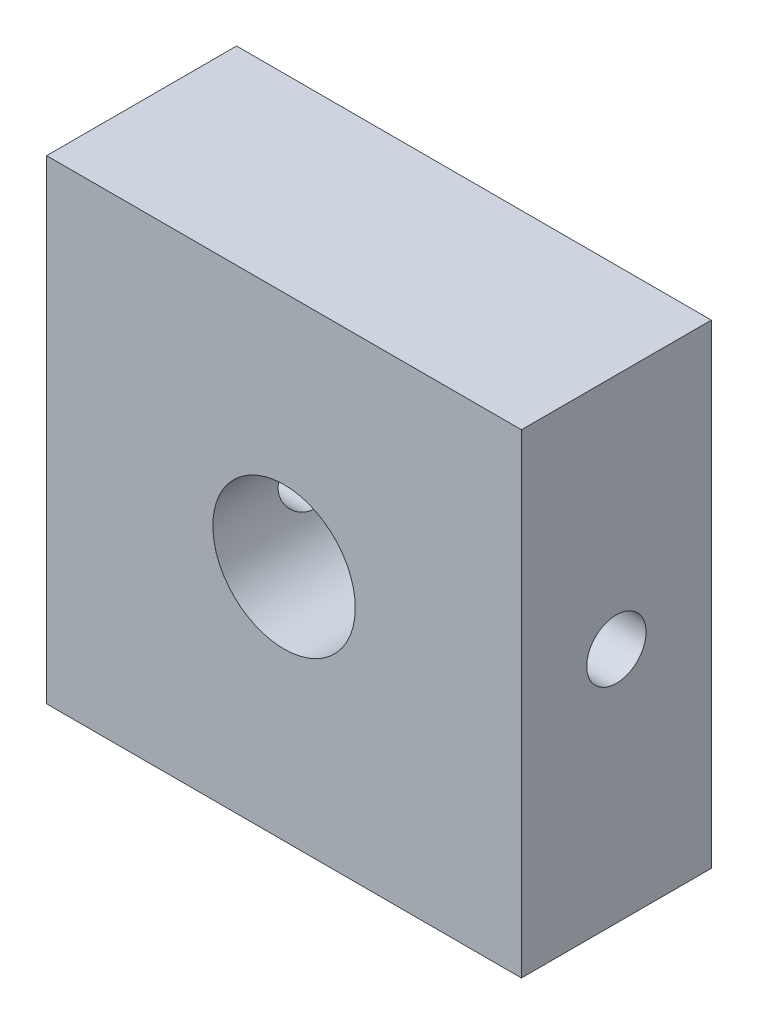
ISO-10303-21;
HEADER;
FILE_DESCRIPTION(('STEP AP214'),'2;1');
FILE_NAME('part.step','',(''),(''),'','','');
FILE_SCHEMA(('AUTOMOTIVE_DESIGN { 1 0 10303 214 1 1 1 1 }'));
ENDSEC;
DATA;
#1=APPLICATION_CONTEXT('core data for automotive mechanical design processes');
#2=APPLICATION_PROTOCOL_DEFINITION('international standard','automotive_design',2000,#1);
#3=PRODUCT_CONTEXT('',#1,'mechanical');
#4=PRODUCT('Part','Part','',(#3));
#5=PRODUCT_RELATED_PRODUCT_CATEGORY('part','',(#4));
#6=PRODUCT_DEFINITION_FORMATION('','',#4);
#7=PRODUCT_DEFINITION_CONTEXT('part definition',#1,'design');
#8=PRODUCT_DEFINITION('design','',#6,#7);
#9=PRODUCT_DEFINITION_SHAPE('','',#8);
#10=(LENGTH_UNIT() NAMED_UNIT(*) SI_UNIT(.MILLI.,.METRE.));
#11=(NAMED_UNIT(*) PLANE_ANGLE_UNIT() SI_UNIT($,.RADIAN.));
#12=(NAMED_UNIT(*) SI_UNIT($,.STERADIAN.) SOLID_ANGLE_UNIT());
#13=UNCERTAINTY_MEASURE_WITH_UNIT(LENGTH_MEASURE(1.E-05),#10,'distance_accuracy_value','');
#14=(GEOMETRIC_REPRESENTATION_CONTEXT(3) GLOBAL_UNCERTAINTY_ASSIGNED_CONTEXT((#13)) GLOBAL_UNIT_ASSIGNED_CONTEXT((#10,
#11,#12)) REPRESENTATION_CONTEXT('',''));
#15=CARTESIAN_POINT('',(0.,0.,0.));
#16=DIRECTION('',(0.,0.,1.));
#17=DIRECTION('',(1.,0.,0.));
#18=AXIS2_PLACEMENT_3D('',#15,#16,#17);
#19=CARTESIAN_POINT('',(-152.646542572468,-146.366308719574,8.));
#20=DIRECTION('',(-1.,0.,0.));
#21=DIRECTION('',(0.,0.,1.));
#22=AXIS2_PLACEMENT_3D('',#19,#20,#21);
#23=PLANE('',#22);
#24=CARTESIAN_POINT('',(-152.646542572468,-136.366308719574,4.));
#25=DIRECTION('',(1.,0.,0.));
#26=DIRECTION('',(0.,0.,-1.));
#27=AXIS2_PLACEMENT_3D('',#24,#25,#26);
#28=CIRCLE('',#27,1.25);
#29=CARTESIAN_POINT('',(-152.646542572468,-136.366308719574,2.75));
#30=VERTEX_POINT('',#29);
#31=EDGE_CURVE('E140',#30,#30,#28,.T.);
#32=ORIENTED_EDGE('',*,*,#31,.F.);
#33=EDGE_LOOP('',(#32));
#34=FACE_BOUND('',#33,.T.);
#35=DIRECTION('',(0.,1.,0.));
#36=VECTOR('',#35,1.);
#37=CARTESIAN_POINT('',(-152.646542572468,-146.366308719574,0.));
#38=LINE('',#37,#36);
#39=CARTESIAN_POINT('',(-152.646542572468,-146.366308719574,0.));
#40=VERTEX_POINT('',#39);
#41=CARTESIAN_POINT('',(-152.646542572468,-126.366308719574,0.));
#42=VERTEX_POINT('',#41);
#43=EDGE_CURVE('E104',#40,#42,#38,.T.);
#44=ORIENTED_EDGE('',*,*,#43,.T.);
#45=DIRECTION('',(0.,0.,-1.));
#46=VECTOR('',#45,1.);
#47=CARTESIAN_POINT('',(-152.646542572468,-126.366308719574,8.));
#48=LINE('',#47,#46);
#49=CARTESIAN_POINT('',(-152.646542572468,-126.366308719574,8.));
#50=VERTEX_POINT('',#49);
#51=EDGE_CURVE('E11',#50,#42,#48,.T.);
#52=ORIENTED_EDGE('',*,*,#51,.F.);
#53=DIRECTION('',(0.,1.,0.));
#54=VECTOR('',#53,1.);
#55=CARTESIAN_POINT('',(-152.646542572468,-146.366308719574,8.));
#56=LINE('',#55,#54);
#57=CARTESIAN_POINT('',(-152.646542572468,-146.366308719574,8.));
#58=VERTEX_POINT('',#57);
#59=EDGE_CURVE('E91',#58,#50,#56,.T.);
#60=ORIENTED_EDGE('',*,*,#59,.F.);
#61=DIRECTION('',(0.,0.,-1.));
#62=VECTOR('',#61,1.);
#63=CARTESIAN_POINT('',(-152.646542572468,-146.366308719574,8.));
#64=LINE('',#63,#62);
#65=EDGE_CURVE('E100',#58,#40,#64,.T.);
#66=ORIENTED_EDGE('',*,*,#65,.T.);
#67=EDGE_LOOP('',(#44,#52,#60,#66));
#68=FACE_BOUND('',#67,.T.);
#69=ADVANCED_FACE('F33',(#34,#68),#23,.F.);
#70=CARTESIAN_POINT('',(-172.646542572468,-126.366308719574,8.));
#71=DIRECTION('',(0.,-1.,0.));
#72=DIRECTION('',(0.,0.,-1.));
#73=AXIS2_PLACEMENT_3D('',#70,#71,#72);
#74=PLANE('',#73);
#75=DIRECTION('',(-1.,0.,0.));
#76=VECTOR('',#75,1.);
#77=CARTESIAN_POINT('',(-172.646542572468,-126.366308719574,0.));
#78=LINE('',#77,#76);
#79=CARTESIAN_POINT('',(-172.646542572468,-126.366308719574,0.));
#80=VERTEX_POINT('',#79);
#81=EDGE_CURVE('E95',#42,#80,#78,.T.);
#82=ORIENTED_EDGE('',*,*,#81,.T.);
#83=DIRECTION('',(0.,0.,-1.));
#84=VECTOR('',#83,1.);
#85=CARTESIAN_POINT('',(-172.646542572468,-126.366308719574,8.));
#86=LINE('',#85,#84);
#87=CARTESIAN_POINT('',(-172.646542572468,-126.366308719574,8.));
#88=VERTEX_POINT('',#87);
#89=EDGE_CURVE('E47',#88,#80,#86,.T.);
#90=ORIENTED_EDGE('',*,*,#89,.F.);
#91=DIRECTION('',(-1.,0.,0.));
#92=VECTOR('',#91,1.);
#93=CARTESIAN_POINT('',(-172.646542572468,-126.366308719574,8.));
#94=LINE('',#93,#92);
#95=EDGE_CURVE('E86',#50,#88,#94,.T.);
#96=ORIENTED_EDGE('',*,*,#95,.F.);
#97=ORIENTED_EDGE('',*,*,#51,.T.);
#98=EDGE_LOOP('',(#82,#90,#96,#97));
#99=FACE_BOUND('',#98,.T.);
#100=ADVANCED_FACE('F94',(#99),#74,.F.);
#101=CARTESIAN_POINT('',(-172.646542572468,-146.366308719574,8.));
#102=DIRECTION('',(1.,0.,0.));
#103=DIRECTION('',(0.,0.,-1.));
#104=AXIS2_PLACEMENT_3D('',#101,#102,#103);
#105=PLANE('',#104);
#106=CARTESIAN_POINT('',(-172.646542572468,-136.366308719574,4.));
#107=DIRECTION('',(1.,0.,0.));
#108=DIRECTION('',(0.,0.,-1.));
#109=AXIS2_PLACEMENT_3D('',#106,#107,#108);
#110=CIRCLE('',#109,1.25);
#111=CARTESIAN_POINT('',(-172.646542572468,-136.366308719574,2.75));
#112=VERTEX_POINT('',#111);
#113=EDGE_CURVE('E117',#112,#112,#110,.T.);
#114=ORIENTED_EDGE('',*,*,#113,.T.);
#115=EDGE_LOOP('',(#114));
#116=FACE_BOUND('',#115,.T.);
#117=DIRECTION('',(0.,-1.,0.));
#118=VECTOR('',#117,1.);
#119=CARTESIAN_POINT('',(-172.646542572468,-146.366308719574,0.));
#120=LINE('',#119,#118);
#121=CARTESIAN_POINT('',(-172.646542572468,-146.366308719574,0.));
#122=VERTEX_POINT('',#121);
#123=EDGE_CURVE('E73',#80,#122,#120,.T.);
#124=ORIENTED_EDGE('',*,*,#123,.T.);
#125=DIRECTION('',(0.,0.,-1.));
#126=VECTOR('',#125,1.);
#127=CARTESIAN_POINT('',(-172.646542572468,-146.366308719574,8.));
#128=LINE('',#127,#126);
#129=CARTESIAN_POINT('',(-172.646542572468,-146.366308719574,8.));
#130=VERTEX_POINT('',#129);
#131=EDGE_CURVE('E96',#130,#122,#128,.T.);
#132=ORIENTED_EDGE('',*,*,#131,.F.);
#133=DIRECTION('',(0.,-1.,0.));
#134=VECTOR('',#133,1.);
#135=CARTESIAN_POINT('',(-172.646542572468,-146.366308719574,8.));
#136=LINE('',#135,#134);
#137=EDGE_CURVE('E89',#88,#130,#136,.T.);
#138=ORIENTED_EDGE('',*,*,#137,.F.);
#139=ORIENTED_EDGE('',*,*,#89,.T.);
#140=EDGE_LOOP('',(#124,#132,#138,#139));
#141=FACE_BOUND('',#140,.T.);
#142=ADVANCED_FACE('F98',(#116,#141),#105,.F.);
#143=CARTESIAN_POINT('',(-172.646542572468,-146.366308719574,8.));
#144=DIRECTION('',(0.,1.,0.));
#145=DIRECTION('',(0.,0.,1.));
#146=AXIS2_PLACEMENT_3D('',#143,#144,#145);
#147=PLANE('',#146);
#148=DIRECTION('',(1.,0.,0.));
#149=VECTOR('',#148,1.);
#150=CARTESIAN_POINT('',(-172.646542572468,-146.366308719574,0.));
#151=LINE('',#150,#149);
#152=EDGE_CURVE('E79',#122,#40,#151,.T.);
#153=ORIENTED_EDGE('',*,*,#152,.T.);
#154=ORIENTED_EDGE('',*,*,#65,.F.);
#155=DIRECTION('',(1.,0.,0.));
#156=VECTOR('',#155,1.);
#157=CARTESIAN_POINT('',(-172.646542572468,-146.366308719574,8.));
#158=LINE('',#157,#156);
#159=EDGE_CURVE('E56',#130,#58,#158,.T.);
#160=ORIENTED_EDGE('',*,*,#159,.F.);
#161=ORIENTED_EDGE('',*,*,#131,.T.);
#162=EDGE_LOOP('',(#153,#154,#160,#161));
#163=FACE_BOUND('',#162,.T.);
#164=ADVANCED_FACE('F152',(#163),#147,.F.);
#165=CARTESIAN_POINT('',(0.,0.,8.));
#166=DIRECTION('',(0.,0.,-1.));
#167=DIRECTION('',(-1.,0.,0.));
#168=AXIS2_PLACEMENT_3D('',#165,#166,#167);
#169=PLANE('',#168);
#170=CARTESIAN_POINT('',(-162.646542572468,-136.366308719574,8.));
#171=DIRECTION('',(0.,0.,1.));
#172=DIRECTION('',(1.,0.,0.));
#173=AXIS2_PLACEMENT_3D('',#170,#171,#172);
#174=CIRCLE('',#173,3.00000000000002);
#175=CARTESIAN_POINT('',(-159.646542572468,-136.366308719574,8.));
#176=VERTEX_POINT('',#175);
#177=EDGE_CURVE('E168',#176,#176,#174,.T.);
#178=ORIENTED_EDGE('',*,*,#177,.F.);
#179=EDGE_LOOP('',(#178));
#180=FACE_BOUND('',#179,.T.);
#181=ORIENTED_EDGE('',*,*,#59,.T.);
#182=ORIENTED_EDGE('',*,*,#95,.T.);
#183=ORIENTED_EDGE('',*,*,#137,.T.);
#184=ORIENTED_EDGE('',*,*,#159,.T.);
#185=EDGE_LOOP('',(#181,#182,#183,#184));
#186=FACE_BOUND('',#185,.T.);
#187=ADVANCED_FACE('F87',(#180,#186),#169,.F.);
#188=CARTESIAN_POINT('',(0.,0.,0.));
#189=DIRECTION('',(0.,0.,-1.));
#190=DIRECTION('',(-1.,0.,0.));
#191=AXIS2_PLACEMENT_3D('',#188,#189,#190);
#192=PLANE('',#191);
#193=CARTESIAN_POINT('',(-162.646542572468,-136.366308719574,0.));
#194=DIRECTION('',(0.,0.,1.));
#195=DIRECTION('',(1.,0.,0.));
#196=AXIS2_PLACEMENT_3D('',#193,#194,#195);
#197=CIRCLE('',#196,3.00000000000002);
#198=CARTESIAN_POINT('',(-159.646542572468,-136.366308719574,0.));
#199=VERTEX_POINT('',#198);
#200=EDGE_CURVE('E107',#199,#199,#197,.T.);
#201=ORIENTED_EDGE('',*,*,#200,.T.);
#202=EDGE_LOOP('',(#201));
#203=FACE_BOUND('',#202,.T.);
#204=ORIENTED_EDGE('',*,*,#43,.F.);
#205=ORIENTED_EDGE('',*,*,#152,.F.);
#206=ORIENTED_EDGE('',*,*,#123,.F.);
#207=ORIENTED_EDGE('',*,*,#81,.F.);
#208=EDGE_LOOP('',(#204,#205,#206,#207));
#209=FACE_BOUND('',#208,.T.);
#210=ADVANCED_FACE('F143',(#203,#209),#192,.T.);
#211=CARTESIAN_POINT('',(-162.646542572468,-136.366308719574,0.));
#212=DIRECTION('',(0.,0.,1.));
#213=DIRECTION('',(1.,0.,0.));
#214=AXIS2_PLACEMENT_3D('',#211,#212,#213);
#215=CYLINDRICAL_SURFACE('',#214,3.00000000000002);
#216=CARTESIAN_POINT('',(-159.646542572468,-136.366308719574,2.75));
#217=CARTESIAN_POINT('',(-159.646547988795,-136.299350666938,2.7500072050913));
#218=CARTESIAN_POINT('',(-159.648810242721,-136.23228732251,2.75541195852813));
#219=CARTESIAN_POINT('',(-159.657641036672,-136.100061348418,2.77683906492018));
#220=CARTESIAN_POINT('',(-159.664220813457,-136.03490414315,2.79288912446425));
#221=CARTESIAN_POINT('',(-159.680979682086,-135.908619985921,2.8349110917806));
#222=CARTESIAN_POINT('',(-159.691146572718,-135.847480195148,2.86084938946816));
#223=CARTESIAN_POINT('',(-159.714089707761,-135.730478962894,2.92177282323258));
#224=CARTESIAN_POINT('',(-159.726865161539,-135.674615929558,2.95675521897087));
#225=CARTESIAN_POINT('',(-159.754464288949,-135.566860316014,3.03662898259088));
#226=CARTESIAN_POINT('',(-159.769355039207,-135.515267452056,3.08190130878975));
#227=CARTESIAN_POINT('',(-159.799215431783,-135.420148898483,3.18026433478258));
#228=CARTESIAN_POINT('',(-159.8141851114,-135.376627456421,3.23335912489452));
#229=CARTESIAN_POINT('',(-159.843332354338,-135.296771342603,3.34902677756492));
#230=CARTESIAN_POINT('',(-159.857434703734,-135.260895638035,3.41193744842657));
#231=CARTESIAN_POINT('',(-159.882186848898,-135.200369313685,3.54357325792096));
#232=CARTESIAN_POINT('',(-159.892838422459,-135.175712911211,3.61229537948448));
#233=CARTESIAN_POINT('',(-159.908757018591,-135.139562736452,3.75015369176795));
#234=CARTESIAN_POINT('',(-159.91425869595,-135.127492140798,3.81911048339218));
#235=CARTESIAN_POINT('',(-159.919929310273,-135.115056619896,3.9582732926866));
#236=CARTESIAN_POINT('',(-159.920101188215,-135.11468523903,4.02847860002577));
#237=CARTESIAN_POINT('',(-159.915291376859,-135.125224215937,4.16240006043497));
#238=CARTESIAN_POINT('',(-159.910703745231,-135.135271908451,4.22620109656449));
#239=CARTESIAN_POINT('',(-159.89755774473,-135.164916809416,4.35111209100042));
#240=CARTESIAN_POINT('',(-159.888998615432,-135.184515846702,4.4122215314918));
#241=CARTESIAN_POINT('',(-159.86868072474,-135.233089132298,4.53155770299147));
#242=CARTESIAN_POINT('',(-159.856857752976,-135.262254004182,4.5896954209134));
#243=CARTESIAN_POINT('',(-159.831359261057,-135.328996293768,4.70047773388017));
#244=CARTESIAN_POINT('',(-159.81768301117,-135.366577029054,4.75312015061354));
#245=CARTESIAN_POINT('',(-159.788612803688,-135.45281275403,4.85609995873287));
#246=CARTESIAN_POINT('',(-159.773171358423,-135.502135236366,4.90586656738546));
#247=CARTESIAN_POINT('',(-159.743285841342,-135.608579128522,4.9966135029592));
#248=CARTESIAN_POINT('',(-159.728842003698,-135.665702360126,5.0375917716922));
#249=CARTESIAN_POINT('',(-159.702159736903,-135.787860770881,5.11043582361629));
#250=CARTESIAN_POINT('',(-159.689979907034,-135.853048137126,5.1420694451507));
#251=CARTESIAN_POINT('',(-159.66964775832,-135.988456317047,5.19372113960328));
#252=CARTESIAN_POINT('',(-159.66149321401,-136.058674324779,5.21374563194383));
#253=CARTESIAN_POINT('',(-159.650546160604,-136.197380606228,5.24041599212665));
#254=CARTESIAN_POINT('',(-159.647447161996,-136.265697434295,5.24782785744376));
#255=CARTESIAN_POINT('',(-159.64598206878,-136.40266337507,5.25134622361409));
#256=CARTESIAN_POINT('',(-159.647614615348,-136.471312386727,5.247455970252));
#257=CARTESIAN_POINT('',(-159.655230395898,-136.603406961915,5.22902891519393));
#258=CARTESIAN_POINT('',(-159.660993699628,-136.666941686213,5.21503004590279));
#259=CARTESIAN_POINT('',(-159.676056504744,-136.790691468545,5.1775318054592));
#260=CARTESIAN_POINT('',(-159.685356452871,-136.850906106092,5.15403123404969));
#261=CARTESIAN_POINT('',(-159.706959866016,-136.968417719443,5.09742902428786));
#262=CARTESIAN_POINT('',(-159.719347657775,-137.025565956429,5.06405181685394));
#263=CARTESIAN_POINT('',(-159.745804526677,-137.133654935805,4.98894662220826));
#264=CARTESIAN_POINT('',(-159.75987430478,-137.184593072176,4.94721514847069));
#265=CARTESIAN_POINT('',(-159.789421693513,-137.282642149848,4.85309676672757));
#266=CARTESIAN_POINT('',(-159.804928056557,-137.329219417554,4.80016149701372));
#267=CARTESIAN_POINT('',(-159.834699204788,-137.412978565679,4.68697872406459));
#268=CARTESIAN_POINT('',(-159.848963707533,-137.45015831243,4.62672956482824));
#269=CARTESIAN_POINT('',(-159.874728710028,-137.514468321661,4.49938582469738));
#270=CARTESIAN_POINT('',(-159.886186946917,-137.541447901947,4.43220596448513));
#271=CARTESIAN_POINT('',(-159.904459015878,-137.58348285909,4.29362940618986));
#272=CARTESIAN_POINT('',(-159.91127667691,-137.598548068211,4.22223623751662));
#273=CARTESIAN_POINT('',(-159.918910927095,-137.615349523063,4.08318130080076));
#274=CARTESIAN_POINT('',(-159.920149062796,-137.618022523705,4.01565533770736));
#275=CARTESIAN_POINT('',(-159.917604042357,-137.612464474813,3.88115713885887));
#276=CARTESIAN_POINT('',(-159.913821657065,-137.604235099221,3.81418481968628));
#277=CARTESIAN_POINT('',(-159.902047059445,-137.577892767379,3.68590725253109));
#278=CARTESIAN_POINT('',(-159.894259024003,-137.560257755289,3.62448332653659));
#279=CARTESIAN_POINT('',(-159.875510760476,-137.516072001595,3.50545197864275));
#280=CARTESIAN_POINT('',(-159.864549641151,-137.489518754746,3.44784563460119));
#281=CARTESIAN_POINT('',(-159.839873026868,-137.426411578929,3.33430410405085));
#282=CARTESIAN_POINT('',(-159.826031545331,-137.389352328679,3.2786776698317));
#283=CARTESIAN_POINT('',(-159.797505681929,-137.306992792204,3.1741398606393));
#284=CARTESIAN_POINT('',(-159.782821009009,-137.26168964848,3.1252308243994));
#285=CARTESIAN_POINT('',(-159.752978643967,-137.160210765353,3.03185131831522));
#286=CARTESIAN_POINT('',(-159.73786439735,-137.103483459523,2.98796356715932));
#287=CARTESIAN_POINT('',(-159.709941136247,-136.982908798827,2.91030054645635));
#288=CARTESIAN_POINT('',(-159.6971331733,-136.91905821752,2.87652988511043));
#289=CARTESIAN_POINT('',(-159.675450738843,-136.787040776292,2.8207901545601));
#290=CARTESIAN_POINT('',(-159.666514746648,-136.718962710555,2.79863523338269));
#291=CARTESIAN_POINT('',(-159.653332474781,-136.57971914142,2.76629367092216));
#292=CARTESIAN_POINT('',(-159.649071514348,-136.508564036555,2.75606955747011));
#293=CARTESIAN_POINT('',(-159.646819696778,-136.413544801493,2.75066683891355));
#294=CARTESIAN_POINT('',(-159.646540661442,-136.38993331425,2.74999745785078));
#295=CARTESIAN_POINT('',(-159.646542572468,-136.366308719574,2.75));
#296=B_SPLINE_CURVE_WITH_KNOTS('',3,(#216,#217,#218,#219,#220,#221,#222,#223,#224,#225,#226,
#227,#228,#229,#230,#231,#232,#233,#234,#235,#236,#237,#238,#239,#240,#241,#242,#243,#244,#245,
#246,#247,#248,#249,#250,#251,#252,#253,#254,#255,#256,#257,#258,#259,#260,#261,#262,#263,#264,
#265,#266,#267,#268,#269,#270,#271,#272,#273,#274,#275,#276,#277,#278,#279,#280,#281,#282,#283,
#284,#285,#286,#287,#288,#289,#290,#291,#292,#293,#294,#295),.UNSPECIFIED.,.T.,.F.,(4,2,2,2,2,2,
2,2,2,2,2,2,2,2,2,2,2,2,2,2,2,2,2,2,2,2,2,2,2,2,2,2,2,2,2,2,2,2,2,4),(0.,0.200806918883929,
0.402138540628694,0.602791851906297,0.803384436852946,1.01317936288805,1.22308438131466,
1.44331724539126,1.66343646730588,1.87295273137558,2.08235338249047,2.27570157202557,
2.46908679727213,2.66658713058716,2.86416545717208,3.07844141127898,3.29276749314591,
3.51204055060816,3.731192242183,3.93648443393255,4.14171767493173,4.33676589735723,
4.53183876601786,4.73297135272166,4.93418805469498,5.14978488029295,5.36543061240343,
5.58414788359526,5.80268447074581,6.00439877559645,6.20608211297538,6.39837649964762,
6.59072494950613,6.79463893397442,6.99862373425946,7.21746535004895,7.43640649428585,
7.65172855819388,7.86637250469324,7.937222564991),.UNSPECIFIED.);
#297=CARTESIAN_POINT('',(-159.646542572468,-136.366308719574,2.75));
#298=VERTEX_POINT('',#297);
#299=EDGE_CURVE('E36',#298,#298,#296,.T.);
#300=ORIENTED_EDGE('',*,*,#299,.T.);
#301=EDGE_LOOP('',(#300));
#302=FACE_BOUND('',#301,.T.);
#303=CARTESIAN_POINT('',(-165.646542572468,-136.366308719574,2.75));
#304=CARTESIAN_POINT('',(-165.64653715614,-136.43326677221,2.7500072050913));
#305=CARTESIAN_POINT('',(-165.644274902215,-136.500330116638,2.75541195852813));
#306=CARTESIAN_POINT('',(-165.635444108263,-136.63255609073,2.77683906492018));
#307=CARTESIAN_POINT('',(-165.628864331478,-136.697713295998,2.79288912446425));
#308=CARTESIAN_POINT('',(-165.612105462849,-136.823997453227,2.83491109178058));
#309=CARTESIAN_POINT('',(-165.601938572218,-136.885137244,2.86084938946814));
#310=CARTESIAN_POINT('',(-165.578995437174,-137.002138476254,2.92177282323255));
#311=CARTESIAN_POINT('',(-165.566219983396,-137.05800150959,2.95675521897086));
#312=CARTESIAN_POINT('',(-165.538620855986,-137.165757123133,3.03662898259088));
#313=CARTESIAN_POINT('',(-165.523730105729,-137.217349987092,3.08190130878975));
#314=CARTESIAN_POINT('',(-165.493869713153,-137.312468540665,3.18026433478257));
#315=CARTESIAN_POINT('',(-165.478900033536,-137.355989982727,3.23335912489451));
#316=CARTESIAN_POINT('',(-165.449752790598,-137.435846096545,3.3490267775649));
#317=CARTESIAN_POINT('',(-165.435650441202,-137.471721801113,3.41193744842654));
#318=CARTESIAN_POINT('',(-165.410898296038,-137.532248125463,3.54357325792092));
#319=CARTESIAN_POINT('',(-165.400246722476,-137.556904527937,3.61229537948445));
#320=CARTESIAN_POINT('',(-165.384328126345,-137.593054702696,3.75015369176792));
#321=CARTESIAN_POINT('',(-165.378826448986,-137.60512529835,3.81911048339215));
#322=CARTESIAN_POINT('',(-165.373155834663,-137.617560819252,3.95827329268657));
#323=CARTESIAN_POINT('',(-165.37298395672,-137.617932200118,4.02847860002574));
#324=CARTESIAN_POINT('',(-165.377793768076,-137.607393223211,4.16240006043494));
#325=CARTESIAN_POINT('',(-165.382381399704,-137.597345530697,4.22620109656446));
#326=CARTESIAN_POINT('',(-165.395527400206,-137.567700629732,4.35111209100038));
#327=CARTESIAN_POINT('',(-165.404086529503,-137.548101592446,4.41222153149177));
#328=CARTESIAN_POINT('',(-165.424404420195,-137.49952830685,4.53155770299144));
#329=CARTESIAN_POINT('',(-165.436227391959,-137.470363434966,4.58969542091337));
#330=CARTESIAN_POINT('',(-165.461725883879,-137.40362114538,4.70047773388014));
#331=CARTESIAN_POINT('',(-165.475402133766,-137.366040410093,4.75312015061351));
#332=CARTESIAN_POINT('',(-165.504472341248,-137.279804685118,4.85609995873283));
#333=CARTESIAN_POINT('',(-165.519913786512,-137.230482202782,4.90586656738543));
#334=CARTESIAN_POINT('',(-165.549799303593,-137.124038310626,4.99661350295918));
#335=CARTESIAN_POINT('',(-165.564243141238,-137.066915079022,5.03759177169218));
#336=CARTESIAN_POINT('',(-165.590925408032,-136.944756668267,5.11043582361627));
#337=CARTESIAN_POINT('',(-165.603105237901,-136.879569302022,5.14206944515068));
#338=CARTESIAN_POINT('',(-165.623437386616,-136.744161122101,5.19372113960326));
#339=CARTESIAN_POINT('',(-165.631591930926,-136.673943114369,5.21374563194382));
#340=CARTESIAN_POINT('',(-165.642538984332,-136.53523683292,5.24041599212664));
#341=CARTESIAN_POINT('',(-165.645637982939,-136.466920004853,5.24782785744375));
#342=CARTESIAN_POINT('',(-165.647103076155,-136.329954064078,5.2513462236141));
#343=CARTESIAN_POINT('',(-165.645470529587,-136.261305052421,5.247455970252));
#344=CARTESIAN_POINT('',(-165.637854749037,-136.129210477233,5.22902891519394));
#345=CARTESIAN_POINT('',(-165.632091445308,-136.065675752935,5.21503004590281));
#346=CARTESIAN_POINT('',(-165.617028640192,-135.941925970603,5.17753180545922));
#347=CARTESIAN_POINT('',(-165.607728692065,-135.881711333056,5.1540312340497));
#348=CARTESIAN_POINT('',(-165.586125278919,-135.764199719705,5.09742902428788));
#349=CARTESIAN_POINT('',(-165.573737487161,-135.707051482719,5.06405181685397));
#350=CARTESIAN_POINT('',(-165.547280618259,-135.598962503343,4.98894662220831));
#351=CARTESIAN_POINT('',(-165.533210840155,-135.548024366972,4.94721514847073));
#352=CARTESIAN_POINT('',(-165.503663451422,-135.4499752893,4.85309676672759));
#353=CARTESIAN_POINT('',(-165.488157088378,-135.403398021594,4.80016149701374));
#354=CARTESIAN_POINT('',(-165.458385940148,-135.319638873468,4.68697872406462));
#355=CARTESIAN_POINT('',(-165.444121437402,-135.282459126718,4.62672956482828));
#356=CARTESIAN_POINT('',(-165.418356434908,-135.218149117487,4.49938582469744));
#357=CARTESIAN_POINT('',(-165.406898198019,-135.191169537201,4.43220596448518));
#358=CARTESIAN_POINT('',(-165.388626129057,-135.149134580058,4.2936294061899));
#359=CARTESIAN_POINT('',(-165.381808468025,-135.134069370937,4.22223623751665));
#360=CARTESIAN_POINT('',(-165.37417421784,-135.117267916085,4.08318130080078));
#361=CARTESIAN_POINT('',(-165.372936082139,-135.114594915443,4.01565533770738));
#362=CARTESIAN_POINT('',(-165.375481102578,-135.120152964335,3.88115713885889));
#363=CARTESIAN_POINT('',(-165.379263487871,-135.128382339927,3.8141848196863));
#364=CARTESIAN_POINT('',(-165.39103808549,-135.154724671769,3.6859072525311));
#365=CARTESIAN_POINT('',(-165.398826120933,-135.172359683859,3.6244833265366));
#366=CARTESIAN_POINT('',(-165.41757438446,-135.216545437553,3.50545197864276));
#367=CARTESIAN_POINT('',(-165.428535503785,-135.243098684401,3.44784563460121));
#368=CARTESIAN_POINT('',(-165.453212118068,-135.306205860219,3.33430410405087));
#369=CARTESIAN_POINT('',(-165.467053599605,-135.343265110469,3.27867766983171));
#370=CARTESIAN_POINT('',(-165.495579463006,-135.425624646944,3.17413986063932));
#371=CARTESIAN_POINT('',(-165.510264135926,-135.470927790668,3.12523082439942));
#372=CARTESIAN_POINT('',(-165.540106500969,-135.572406673795,3.03185131831526));
#373=CARTESIAN_POINT('',(-165.555220747586,-135.629133979625,2.98796356715935));
#374=CARTESIAN_POINT('',(-165.583144008688,-135.749708640321,2.91030054645637));
#375=CARTESIAN_POINT('',(-165.595951971635,-135.813559221628,2.87652988511044));
#376=CARTESIAN_POINT('',(-165.617634406092,-135.945576662856,2.82079015456011));
#377=CARTESIAN_POINT('',(-165.626570398287,-136.013654728593,2.7986352333827));
#378=CARTESIAN_POINT('',(-165.639752670154,-136.152898297727,2.76629367092216));
#379=CARTESIAN_POINT('',(-165.644013630587,-136.224053402593,2.75606955747011));
#380=CARTESIAN_POINT('',(-165.646265448157,-136.319072637655,2.75066683891355));
#381=CARTESIAN_POINT('',(-165.646544483493,-136.342684124898,2.74999745785078));
#382=CARTESIAN_POINT('',(-165.646542572468,-136.366308719574,2.75));
#383=B_SPLINE_CURVE_WITH_KNOTS('',3,(#303,#304,#305,#306,#307,#308,#309,#310,#311,#312,#313,
#314,#315,#316,#317,#318,#319,#320,#321,#322,#323,#324,#325,#326,#327,#328,#329,#330,#331,#332,
#333,#334,#335,#336,#337,#338,#339,#340,#341,#342,#343,#344,#345,#346,#347,#348,#349,#350,#351,
#352,#353,#354,#355,#356,#357,#358,#359,#360,#361,#362,#363,#364,#365,#366,#367,#368,#369,#370,
#371,#372,#373,#374,#375,#376,#377,#378,#379,#380,#381,#382),.UNSPECIFIED.,.T.,.F.,(4,2,2,2,2,2,
2,2,2,2,2,2,2,2,2,2,2,2,2,2,2,2,2,2,2,2,2,2,2,2,2,2,2,2,2,2,2,2,2,4),(0.,0.200806918883957,
0.402138540628693,0.602791851906261,0.803384436852973,1.01317936288805,1.22308438131468,
1.44331724539125,1.66343646730588,1.87295273137557,2.08235338249046,2.27570157202556,
2.46908679727213,2.66658713058714,2.86416545717206,3.07844141127894,3.29276749314587,
3.51204055060813,3.73119224218297,3.93648443393252,4.14171767493173,4.3367658973572,
4.53183876601785,4.73297135272161,4.93418805469496,5.14978488029294,5.36543061240341,
5.58414788359524,5.80268447074582,6.00439877559646,6.20608211297538,6.39837649964765,
6.59072494950615,6.79463893397441,6.99862373425947,7.21746535004891,7.43640649428584,
7.65172855819384,7.86637250469324,7.93722256499099),.UNSPECIFIED.);
#384=CARTESIAN_POINT('',(-165.646542572468,-136.366308719574,2.75));
#385=VERTEX_POINT('',#384);
#386=EDGE_CURVE('E112',#385,#385,#383,.T.);
#387=ORIENTED_EDGE('',*,*,#386,.T.);
#388=EDGE_LOOP('',(#387));
#389=FACE_BOUND('',#388,.T.);
#390=ORIENTED_EDGE('',*,*,#200,.F.);
#391=EDGE_LOOP('',(#390));
#392=FACE_BOUND('',#391,.T.);
#393=ORIENTED_EDGE('',*,*,#177,.T.);
#394=EDGE_LOOP('',(#393));
#395=FACE_BOUND('',#394,.T.);
#396=ADVANCED_FACE('F118',(#302,#389,#392,#395),#215,.F.);
#397=CARTESIAN_POINT('',(-172.646542572468,-136.366308719574,4.));
#398=DIRECTION('',(1.,0.,0.));
#399=DIRECTION('',(0.,0.,-1.));
#400=AXIS2_PLACEMENT_3D('',#397,#398,#399);
#401=CYLINDRICAL_SURFACE('',#400,1.25);
#402=ORIENTED_EDGE('',*,*,#113,.F.);
#403=EDGE_LOOP('',(#402));
#404=FACE_BOUND('',#403,.T.);
#405=ORIENTED_EDGE('',*,*,#386,.F.);
#406=EDGE_LOOP('',(#405));
#407=FACE_BOUND('',#406,.T.);
#408=ADVANCED_FACE('F124',(#404,#407),#401,.F.);
#409=ORIENTED_EDGE('',*,*,#31,.T.);
#410=EDGE_LOOP('',(#409));
#411=FACE_BOUND('',#410,.T.);
#412=ORIENTED_EDGE('',*,*,#299,.F.);
#413=EDGE_LOOP('',(#412));
#414=FACE_BOUND('',#413,.T.);
#415=ADVANCED_FACE('F121',(#411,#414),#401,.F.);
#416=CLOSED_SHELL('',(#69,#100,#142,#164,#187,#210,#396,#408,#415));
#417=MANIFOLD_SOLID_BREP('B2',#416);
#418=ADVANCED_BREP_SHAPE_REPRESENTATION('',(#18,#417),#14);
#419=SHAPE_DEFINITION_REPRESENTATION(#9,#418);
ENDSEC;
END-ISO-10303-21;
